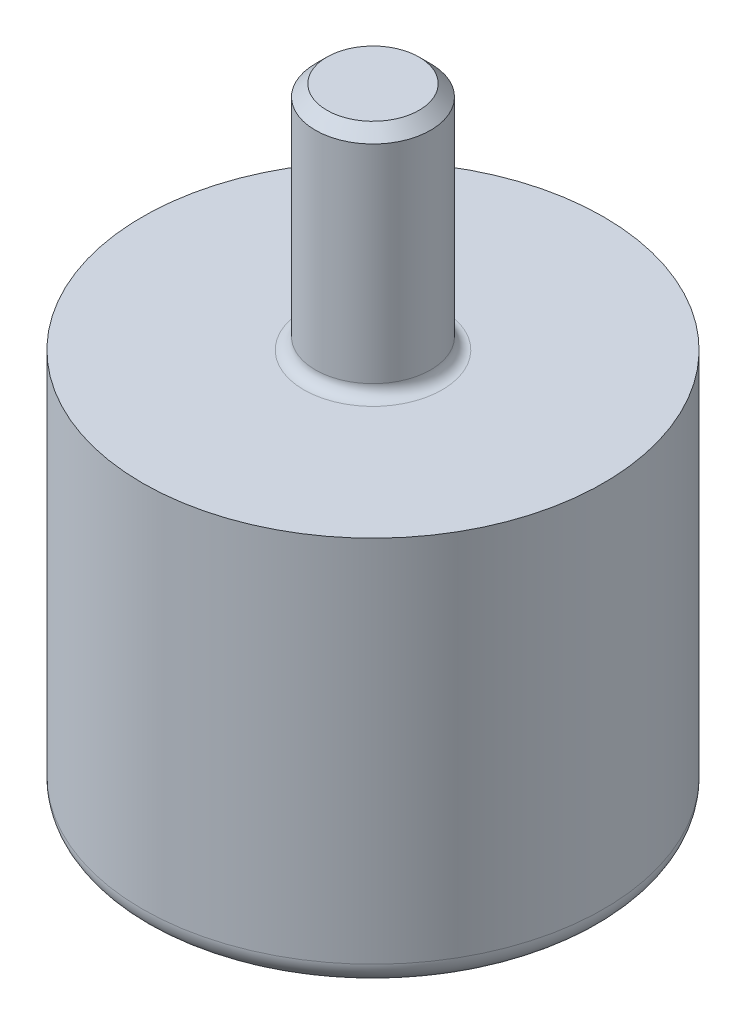
ISO-10303-21;
HEADER;
FILE_DESCRIPTION(('STEP AP214'),'2;1');
FILE_NAME('part.step','',(''),(''),'','','');
FILE_SCHEMA(('AUTOMOTIVE_DESIGN { 1 0 10303 214 1 1 1 1 }'));
ENDSEC;
DATA;
#1=APPLICATION_CONTEXT('core data for automotive mechanical design processes');
#2=APPLICATION_PROTOCOL_DEFINITION('international standard','automotive_design',2000,#1);
#3=PRODUCT_CONTEXT('',#1,'mechanical');
#4=PRODUCT('Part','Part','',(#3));
#5=PRODUCT_RELATED_PRODUCT_CATEGORY('part','',(#4));
#6=PRODUCT_DEFINITION_FORMATION('','',#4);
#7=PRODUCT_DEFINITION_CONTEXT('part definition',#1,'design');
#8=PRODUCT_DEFINITION('design','',#6,#7);
#9=PRODUCT_DEFINITION_SHAPE('','',#8);
#10=(LENGTH_UNIT() NAMED_UNIT(*) SI_UNIT(.MILLI.,.METRE.));
#11=(NAMED_UNIT(*) PLANE_ANGLE_UNIT() SI_UNIT($,.RADIAN.));
#12=(NAMED_UNIT(*) SI_UNIT($,.STERADIAN.) SOLID_ANGLE_UNIT());
#13=UNCERTAINTY_MEASURE_WITH_UNIT(LENGTH_MEASURE(1.E-05),#10,'distance_accuracy_value','');
#14=(GEOMETRIC_REPRESENTATION_CONTEXT(3) GLOBAL_UNCERTAINTY_ASSIGNED_CONTEXT((#13)) GLOBAL_UNIT_ASSIGNED_CONTEXT((#10,
#11,#12)) REPRESENTATION_CONTEXT('',''));
#15=CARTESIAN_POINT('',(0.,0.,0.));
#16=DIRECTION('',(0.,0.,1.));
#17=DIRECTION('',(1.,0.,0.));
#18=AXIS2_PLACEMENT_3D('',#15,#16,#17);
#19=CARTESIAN_POINT('',(0.,17.,0.));
#20=DIRECTION('',(0.,1.,0.));
#21=DIRECTION('',(0.,0.,1.));
#22=AXIS2_PLACEMENT_3D('',#19,#20,#21);
#23=PLANE('',#22);
#24=CARTESIAN_POINT('',(0.,17.,0.));
#25=DIRECTION('',(0.,1.,0.));
#26=DIRECTION('',(0.,0.,1.));
#27=AXIS2_PLACEMENT_3D('',#24,#25,#26);
#28=CIRCLE('',#27,3.);
#29=CARTESIAN_POINT('',(0.,17.,3.));
#30=VERTEX_POINT('',#29);
#31=EDGE_CURVE('E10',#30,#30,#28,.F.);
#32=ORIENTED_EDGE('',*,*,#31,.T.);
#33=EDGE_LOOP('',(#32));
#34=FACE_BOUND('',#33,.T.);
#35=CARTESIAN_POINT('',(0.,17.,0.));
#36=DIRECTION('',(0.,-1.,0.));
#37=DIRECTION('',(0.,0.,-1.));
#38=AXIS2_PLACEMENT_3D('',#35,#36,#37);
#39=CIRCLE('',#38,10.);
#40=CARTESIAN_POINT('',(0.,17.,-10.));
#41=VERTEX_POINT('',#40);
#42=EDGE_CURVE('E58',#41,#41,#39,.T.);
#43=ORIENTED_EDGE('',*,*,#42,.F.);
#44=EDGE_LOOP('',(#43));
#45=FACE_BOUND('',#44,.T.);
#46=ADVANCED_FACE('F29',(#34,#45),#23,.T.);
#47=CARTESIAN_POINT('',(0.,3.25,0.));
#48=DIRECTION('',(0.,-1.,0.));
#49=DIRECTION('',(1.,0.,0.));
#50=AXIS2_PLACEMENT_3D('',#47,#48,#49);
#51=SPHERICAL_SURFACE('',#50,6.25);
#52=CARTESIAN_POINT('',(0.,0.,0.));
#53=DIRECTION('',(0.,-1.,0.));
#54=DIRECTION('',(0.,0.,-1.));
#55=AXIS2_PLACEMENT_3D('',#52,#53,#54);
#56=CIRCLE('',#55,5.33853912601565);
#57=CARTESIAN_POINT('',(0.,0.,-5.33853912601565));
#58=VERTEX_POINT('',#57);
#59=EDGE_CURVE('E55',#58,#58,#56,.T.);
#60=ORIENTED_EDGE('',*,*,#59,.T.);
#61=EDGE_LOOP('',(#60));
#62=FACE_BOUND('',#61,.T.);
#63=ADVANCED_FACE('F65',(#62),#51,.F.);
#64=CARTESIAN_POINT('',(10.,0.,0.));
#65=DIRECTION('',(0.,-1.,0.));
#66=DIRECTION('',(0.,0.,-1.));
#67=AXIS2_PLACEMENT_3D('',#64,#65,#66);
#68=PLANE('',#67);
#69=CARTESIAN_POINT('',(0.,0.,0.));
#70=DIRECTION('',(0.,-1.,0.));
#71=DIRECTION('',(0.,0.,-1.));
#72=AXIS2_PLACEMENT_3D('',#69,#70,#71);
#73=CIRCLE('',#72,9.);
#74=CARTESIAN_POINT('',(0.,0.,-9.));
#75=VERTEX_POINT('',#74);
#76=EDGE_CURVE('E52',#75,#75,#73,.T.);
#77=ORIENTED_EDGE('',*,*,#76,.T.);
#78=EDGE_LOOP('',(#77));
#79=FACE_BOUND('',#78,.T.);
#80=ORIENTED_EDGE('',*,*,#59,.F.);
#81=EDGE_LOOP('',(#80));
#82=FACE_BOUND('',#81,.T.);
#83=ADVANCED_FACE('F70',(#79,#82),#68,.T.);
#84=CARTESIAN_POINT('',(0.,0.,0.));
#85=DIRECTION('',(0.,-1.,0.));
#86=DIRECTION('',(0.,0.,-1.));
#87=AXIS2_PLACEMENT_3D('',#84,#85,#86);
#88=CYLINDRICAL_SURFACE('',#87,10.);
#89=CARTESIAN_POINT('',(0.,1.,0.));
#90=DIRECTION('',(0.,-1.,0.));
#91=DIRECTION('',(0.,0.,-1.));
#92=AXIS2_PLACEMENT_3D('',#89,#90,#91);
#93=CIRCLE('',#92,10.);
#94=CARTESIAN_POINT('',(0.,1.,-10.));
#95=VERTEX_POINT('',#94);
#96=EDGE_CURVE('E49',#95,#95,#93,.F.);
#97=ORIENTED_EDGE('',*,*,#96,.T.);
#98=EDGE_LOOP('',(#97));
#99=FACE_BOUND('',#98,.T.);
#100=ORIENTED_EDGE('',*,*,#42,.T.);
#101=EDGE_LOOP('',(#100));
#102=FACE_BOUND('',#101,.T.);
#103=ADVANCED_FACE('F62',(#99,#102),#88,.T.);
#104=CARTESIAN_POINT('',(0.,27.,0.));
#105=DIRECTION('',(0.,-1.,0.));
#106=DIRECTION('',(0.,0.,-1.));
#107=AXIS2_PLACEMENT_3D('',#104,#105,#106);
#108=CYLINDRICAL_SURFACE('',#107,2.5);
#109=CARTESIAN_POINT('',(0.,17.5,0.));
#110=DIRECTION('',(0.,1.,0.));
#111=DIRECTION('',(0.,0.,1.));
#112=AXIS2_PLACEMENT_3D('',#109,#110,#111);
#113=CIRCLE('',#112,2.5);
#114=CARTESIAN_POINT('',(0.,17.5,2.5));
#115=VERTEX_POINT('',#114);
#116=EDGE_CURVE('E36',#115,#115,#113,.T.);
#117=ORIENTED_EDGE('',*,*,#116,.T.);
#118=EDGE_LOOP('',(#117));
#119=FACE_BOUND('',#118,.T.);
#120=CARTESIAN_POINT('',(0.,26.5,0.));
#121=DIRECTION('',(0.,1.,0.));
#122=DIRECTION('',(0.,0.,1.));
#123=AXIS2_PLACEMENT_3D('',#120,#121,#122);
#124=CIRCLE('',#123,2.5);
#125=CARTESIAN_POINT('',(0.,26.5,2.5));
#126=VERTEX_POINT('',#125);
#127=EDGE_CURVE('E40',#126,#126,#124,.F.);
#128=ORIENTED_EDGE('',*,*,#127,.T.);
#129=EDGE_LOOP('',(#128));
#130=FACE_BOUND('',#129,.T.);
#131=ADVANCED_FACE('F75',(#119,#130),#108,.T.);
#132=CARTESIAN_POINT('',(0.,27.,0.));
#133=DIRECTION('',(0.,1.,0.));
#134=DIRECTION('',(0.,0.,1.));
#135=AXIS2_PLACEMENT_3D('',#132,#133,#134);
#136=PLANE('',#135);
#137=CARTESIAN_POINT('',(0.,27.,0.));
#138=DIRECTION('',(0.,1.,0.));
#139=DIRECTION('',(0.,0.,1.));
#140=AXIS2_PLACEMENT_3D('',#137,#138,#139);
#141=CIRCLE('',#140,1.99999999999999);
#142=CARTESIAN_POINT('',(0.,27.,1.99999999999999));
#143=VERTEX_POINT('',#142);
#144=EDGE_CURVE('E44',#143,#143,#141,.T.);
#145=ORIENTED_EDGE('',*,*,#144,.T.);
#146=EDGE_LOOP('',(#145));
#147=FACE_BOUND('',#146,.T.);
#148=ADVANCED_FACE('F86',(#147),#136,.T.);
#149=CARTESIAN_POINT('',(0.,1.,0.));
#150=DIRECTION('',(0.,-1.,0.));
#151=DIRECTION('',(0.,0.,-1.));
#152=AXIS2_PLACEMENT_3D('',#149,#150,#151);
#153=TOROIDAL_SURFACE('',#152,9.,1.);
#154=ORIENTED_EDGE('',*,*,#96,.F.);
#155=EDGE_LOOP('',(#154));
#156=FACE_BOUND('',#155,.T.);
#157=ORIENTED_EDGE('',*,*,#76,.F.);
#158=EDGE_LOOP('',(#157));
#159=FACE_BOUND('',#158,.T.);
#160=ADVANCED_FACE('F83',(#156,#159),#153,.T.);
#161=CARTESIAN_POINT('',(0.,27.,0.));
#162=DIRECTION('',(0.,-1.,0.));
#163=DIRECTION('',(0.,0.,-1.));
#164=AXIS2_PLACEMENT_3D('',#161,#162,#163);
#165=CONICAL_SURFACE('',#164,1.99999999999999,0.785398163397446);
#166=ORIENTED_EDGE('',*,*,#127,.F.);
#167=EDGE_LOOP('',(#166));
#168=FACE_BOUND('',#167,.T.);
#169=ORIENTED_EDGE('',*,*,#144,.F.);
#170=EDGE_LOOP('',(#169));
#171=FACE_BOUND('',#170,.T.);
#172=ADVANCED_FACE('F85',(#168,#171),#165,.T.);
#173=CARTESIAN_POINT('',(0.,17.5,0.));
#174=DIRECTION('',(0.,1.,0.));
#175=DIRECTION('',(0.,0.,1.));
#176=AXIS2_PLACEMENT_3D('',#173,#174,#175);
#177=TOROIDAL_SURFACE('',#176,3.,0.5);
#178=ORIENTED_EDGE('',*,*,#31,.F.);
#179=EDGE_LOOP('',(#178));
#180=FACE_BOUND('',#179,.T.);
#181=ORIENTED_EDGE('',*,*,#116,.F.);
#182=EDGE_LOOP('',(#181));
#183=FACE_BOUND('',#182,.T.);
#184=ADVANCED_FACE('F31',(#180,#183),#177,.F.);
#185=CLOSED_SHELL('',(#46,#63,#83,#103,#131,#148,#160,#172,#184));
#186=MANIFOLD_SOLID_BREP('B2',#185);
#187=ADVANCED_BREP_SHAPE_REPRESENTATION('',(#18,#186),#14);
#188=SHAPE_DEFINITION_REPRESENTATION(#9,#187);
ENDSEC;
END-ISO-10303-21;
